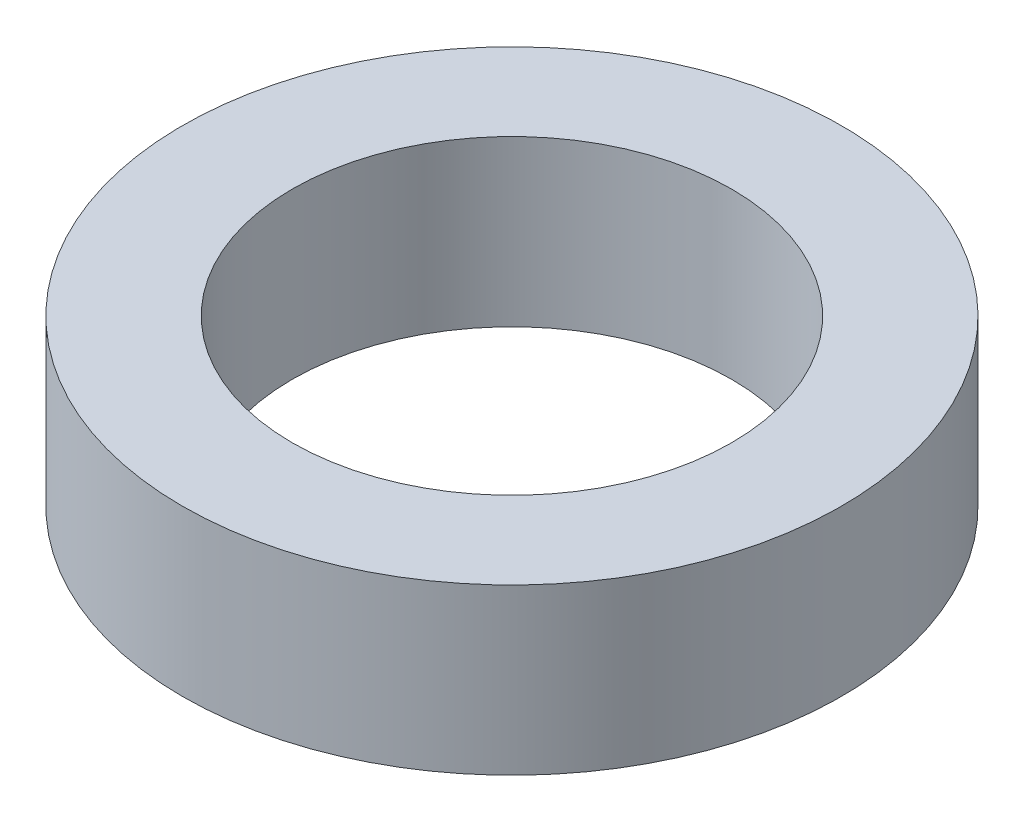
ISO-10303-21;
HEADER;
FILE_DESCRIPTION(('STEP AP214'),'2;1');
FILE_NAME('part.step','',(''),(''),'','','');
FILE_SCHEMA(('AUTOMOTIVE_DESIGN { 1 0 10303 214 1 1 1 1 }'));
ENDSEC;
DATA;
#1=APPLICATION_CONTEXT('core data for automotive mechanical design processes');
#2=APPLICATION_PROTOCOL_DEFINITION('international standard','automotive_design',2000,#1);
#3=PRODUCT_CONTEXT('',#1,'mechanical');
#4=PRODUCT('Part','Part','',(#3));
#5=PRODUCT_RELATED_PRODUCT_CATEGORY('part','',(#4));
#6=PRODUCT_DEFINITION_FORMATION('','',#4);
#7=PRODUCT_DEFINITION_CONTEXT('part definition',#1,'design');
#8=PRODUCT_DEFINITION('design','',#6,#7);
#9=PRODUCT_DEFINITION_SHAPE('','',#8);
#10=(LENGTH_UNIT() NAMED_UNIT(*) SI_UNIT(.MILLI.,.METRE.));
#11=(NAMED_UNIT(*) PLANE_ANGLE_UNIT() SI_UNIT($,.RADIAN.));
#12=(NAMED_UNIT(*) SI_UNIT($,.STERADIAN.) SOLID_ANGLE_UNIT());
#13=UNCERTAINTY_MEASURE_WITH_UNIT(LENGTH_MEASURE(1.E-05),#10,'distance_accuracy_value','');
#14=(GEOMETRIC_REPRESENTATION_CONTEXT(3) GLOBAL_UNCERTAINTY_ASSIGNED_CONTEXT((#13)) GLOBAL_UNIT_ASSIGNED_CONTEXT((#10,
#11,#12)) REPRESENTATION_CONTEXT('',''));
#15=CARTESIAN_POINT('',(0.,0.,0.));
#16=DIRECTION('',(0.,0.,1.));
#17=DIRECTION('',(1.,0.,0.));
#18=AXIS2_PLACEMENT_3D('',#15,#16,#17);
#19=CARTESIAN_POINT('',(0.,4.7625,0.));
#20=DIRECTION('',(0.,1.,0.));
#21=DIRECTION('',(0.,0.,1.));
#22=AXIS2_PLACEMENT_3D('',#19,#20,#21);
#23=PLANE('',#22);
#24=CARTESIAN_POINT('',(0.,4.7625,0.));
#25=DIRECTION('',(0.,1.,0.));
#26=DIRECTION('',(0.,0.,1.));
#27=AXIS2_PLACEMENT_3D('',#24,#25,#26);
#28=CIRCLE('',#27,9.525);
#29=CARTESIAN_POINT('',(0.,4.7625,9.525));
#30=VERTEX_POINT('',#29);
#31=EDGE_CURVE('E10',#30,#30,#28,.T.);
#32=ORIENTED_EDGE('',*,*,#31,.T.);
#33=EDGE_LOOP('',(#32));
#34=FACE_BOUND('',#33,.T.);
#35=CARTESIAN_POINT('',(0.,4.7625,0.));
#36=DIRECTION('',(0.,1.,0.));
#37=DIRECTION('',(0.,0.,1.));
#38=AXIS2_PLACEMENT_3D('',#35,#36,#37);
#39=CIRCLE('',#38,6.35);
#40=CARTESIAN_POINT('',(0.,4.7625,6.35));
#41=VERTEX_POINT('',#40);
#42=EDGE_CURVE('E44',#41,#41,#39,.T.);
#43=ORIENTED_EDGE('',*,*,#42,.F.);
#44=EDGE_LOOP('',(#43));
#45=FACE_BOUND('',#44,.T.);
#46=ADVANCED_FACE('F33',(#34,#45),#23,.T.);
#47=CARTESIAN_POINT('',(0.,0.,0.));
#48=DIRECTION('',(0.,1.,0.));
#49=DIRECTION('',(0.,0.,1.));
#50=AXIS2_PLACEMENT_3D('',#47,#48,#49);
#51=PLANE('',#50);
#52=CARTESIAN_POINT('',(0.,0.,0.));
#53=DIRECTION('',(0.,1.,0.));
#54=DIRECTION('',(0.,0.,1.));
#55=AXIS2_PLACEMENT_3D('',#52,#53,#54);
#56=CIRCLE('',#55,9.525);
#57=CARTESIAN_POINT('',(0.,0.,9.525));
#58=VERTEX_POINT('',#57);
#59=EDGE_CURVE('E37',#58,#58,#56,.T.);
#60=ORIENTED_EDGE('',*,*,#59,.F.);
#61=EDGE_LOOP('',(#60));
#62=FACE_BOUND('',#61,.T.);
#63=CARTESIAN_POINT('',(0.,0.,0.));
#64=DIRECTION('',(0.,1.,0.));
#65=DIRECTION('',(0.,0.,1.));
#66=AXIS2_PLACEMENT_3D('',#63,#64,#65);
#67=CIRCLE('',#66,6.35);
#68=CARTESIAN_POINT('',(0.,0.,6.35));
#69=VERTEX_POINT('',#68);
#70=EDGE_CURVE('E46',#69,#69,#67,.T.);
#71=ORIENTED_EDGE('',*,*,#70,.T.);
#72=EDGE_LOOP('',(#71));
#73=FACE_BOUND('',#72,.T.);
#74=ADVANCED_FACE('F56',(#62,#73),#51,.F.);
#75=CARTESIAN_POINT('',(0.,4.7625,0.));
#76=DIRECTION('',(0.,-1.,0.));
#77=DIRECTION('',(0.,0.,-1.));
#78=AXIS2_PLACEMENT_3D('',#75,#76,#77);
#79=CYLINDRICAL_SURFACE('',#78,9.525);
#80=ORIENTED_EDGE('',*,*,#31,.F.);
#81=EDGE_LOOP('',(#80));
#82=FACE_BOUND('',#81,.T.);
#83=ORIENTED_EDGE('',*,*,#59,.T.);
#84=EDGE_LOOP('',(#83));
#85=FACE_BOUND('',#84,.T.);
#86=ADVANCED_FACE('F35',(#82,#85),#79,.T.);
#87=CARTESIAN_POINT('',(0.,4.7625,0.));
#88=DIRECTION('',(0.,-1.,0.));
#89=DIRECTION('',(0.,0.,-1.));
#90=AXIS2_PLACEMENT_3D('',#87,#88,#89);
#91=CYLINDRICAL_SURFACE('',#90,6.35);
#92=ORIENTED_EDGE('',*,*,#42,.T.);
#93=EDGE_LOOP('',(#92));
#94=FACE_BOUND('',#93,.T.);
#95=ORIENTED_EDGE('',*,*,#70,.F.);
#96=EDGE_LOOP('',(#95));
#97=FACE_BOUND('',#96,.T.);
#98=ADVANCED_FACE('F52',(#94,#97),#91,.F.);
#99=CLOSED_SHELL('',(#46,#74,#86,#98));
#100=MANIFOLD_SOLID_BREP('B2',#99);
#101=ADVANCED_BREP_SHAPE_REPRESENTATION('',(#18,#100),#14);
#102=SHAPE_DEFINITION_REPRESENTATION(#9,#101);
ENDSEC;
END-ISO-10303-21;
